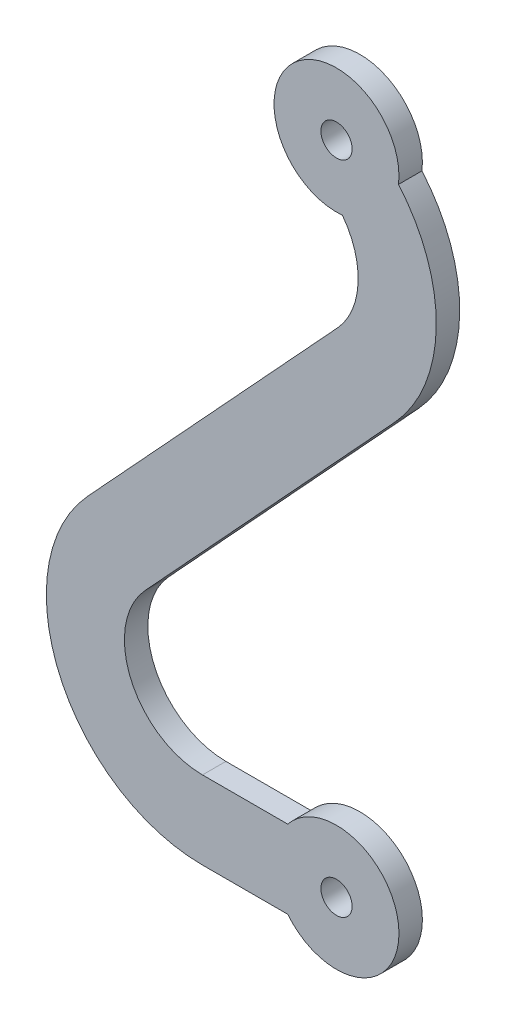
ISO-10303-21;
HEADER;
FILE_DESCRIPTION(('STEP AP214'),'2;1');
FILE_NAME('part.step','',(''),(''),'','','');
FILE_SCHEMA(('AUTOMOTIVE_DESIGN { 1 0 10303 214 1 1 1 1 }'));
ENDSEC;
DATA;
#1=APPLICATION_CONTEXT('core data for automotive mechanical design processes');
#2=APPLICATION_PROTOCOL_DEFINITION('international standard','automotive_design',2000,#1);
#3=PRODUCT_CONTEXT('',#1,'mechanical');
#4=PRODUCT('Part','Part','',(#3));
#5=PRODUCT_RELATED_PRODUCT_CATEGORY('part','',(#4));
#6=PRODUCT_DEFINITION_FORMATION('','',#4);
#7=PRODUCT_DEFINITION_CONTEXT('part definition',#1,'design');
#8=PRODUCT_DEFINITION('design','',#6,#7);
#9=PRODUCT_DEFINITION_SHAPE('','',#8);
#10=(LENGTH_UNIT() NAMED_UNIT(*) SI_UNIT(.MILLI.,.METRE.));
#11=(NAMED_UNIT(*) PLANE_ANGLE_UNIT() SI_UNIT($,.RADIAN.));
#12=(NAMED_UNIT(*) SI_UNIT($,.STERADIAN.) SOLID_ANGLE_UNIT());
#13=UNCERTAINTY_MEASURE_WITH_UNIT(LENGTH_MEASURE(1.E-05),#10,'distance_accuracy_value','');
#14=(GEOMETRIC_REPRESENTATION_CONTEXT(3) GLOBAL_UNCERTAINTY_ASSIGNED_CONTEXT((#13)) GLOBAL_UNIT_ASSIGNED_CONTEXT((#10,
#11,#12)) REPRESENTATION_CONTEXT('',''));
#15=CARTESIAN_POINT('',(0.,0.,0.));
#16=DIRECTION('',(0.,0.,1.));
#17=DIRECTION('',(1.,0.,0.));
#18=AXIS2_PLACEMENT_3D('',#15,#16,#17);
#19=CARTESIAN_POINT('',(-3.61103598299831,35.0044342652001,1.5));
#20=DIRECTION('',(0.,0.,1.));
#21=DIRECTION('',(1.,0.,0.));
#22=AXIS2_PLACEMENT_3D('',#19,#20,#21);
#23=PLANE('',#22);
#24=CARTESIAN_POINT('',(0.,0.,1.5));
#25=DIRECTION('',(0.,0.,1.));
#26=DIRECTION('',(1.,0.,0.));
#27=AXIS2_PLACEMENT_3D('',#24,#25,#26);
#28=CIRCLE('',#27,1.);
#29=CARTESIAN_POINT('',(1.,0.,1.5));
#30=VERTEX_POINT('',#29);
#31=EDGE_CURVE('E158',#30,#30,#28,.T.);
#32=ORIENTED_EDGE('',*,*,#31,.F.);
#33=EDGE_LOOP('',(#32));
#34=FACE_BOUND('',#33,.T.);
#35=CARTESIAN_POINT('',(-3.61103598299831,35.0044342652001,1.5));
#36=DIRECTION('',(0.,0.,-1.));
#37=DIRECTION('',(1.,0.,0.));
#38=AXIS2_PLACEMENT_3D('',#35,#36,#37);
#39=CIRCLE('',#38,5.);
#40=CARTESIAN_POINT('',(0.378773293230176,38.0179740341962,1.5));
#41=VERTEX_POINT('',#40);
#42=CARTESIAN_POINT('',(0.0634117858713278,31.6135002354896,1.5));
#43=VERTEX_POINT('',#42);
#44=EDGE_CURVE('E182',#41,#43,#39,.T.);
#45=ORIENTED_EDGE('',*,*,#44,.T.);
#46=DIRECTION('',(-0.678186805942109,-0.734889553773926,0.));
#47=VECTOR('',#46,1.);
#48=CARTESIAN_POINT('',(-15.9309430214461,14.2818680594211,1.5));
#49=LINE('',#48,#47);
#50=CARTESIAN_POINT('',(-15.9309430214461,14.2818680594211,1.5));
#51=VERTEX_POINT('',#50);
#52=EDGE_CURVE('E106',#43,#51,#49,.T.);
#53=ORIENTED_EDGE('',*,*,#52,.T.);
#54=CARTESIAN_POINT('',(-8.58204748370686,7.5,1.5));
#55=DIRECTION('',(0.,0.,1.));
#56=DIRECTION('',(-1.,0.,0.));
#57=AXIS2_PLACEMENT_3D('',#54,#55,#56);
#58=CIRCLE('',#57,10.);
#59=CARTESIAN_POINT('',(-8.58204748370686,-2.5,1.5));
#60=VERTEX_POINT('',#59);
#61=EDGE_CURVE('E211',#51,#60,#58,.T.);
#62=ORIENTED_EDGE('',*,*,#61,.T.);
#63=DIRECTION('',(1.,0.,0.));
#64=VECTOR('',#63,1.);
#65=CARTESIAN_POINT('',(-3.1224989991992,-2.5,1.5));
#66=LINE('',#65,#64);
#67=CARTESIAN_POINT('',(-3.1224989991992,-2.5,1.5));
#68=VERTEX_POINT('',#67);
#69=EDGE_CURVE('E231',#60,#68,#66,.T.);
#70=ORIENTED_EDGE('',*,*,#69,.T.);
#71=CARTESIAN_POINT('',(0.,0.,1.5));
#72=DIRECTION('',(0.,0.,1.));
#73=DIRECTION('',(1.,0.,0.));
#74=AXIS2_PLACEMENT_3D('',#71,#72,#73);
#75=CIRCLE('',#74,4.);
#76=CARTESIAN_POINT('',(-3.1224989991992,2.5,1.5));
#77=VERTEX_POINT('',#76);
#78=EDGE_CURVE('E227',#68,#77,#75,.T.);
#79=ORIENTED_EDGE('',*,*,#78,.T.);
#80=DIRECTION('',(-1.,0.,0.));
#81=VECTOR('',#80,1.);
#82=CARTESIAN_POINT('',(-3.1224989991992,2.5,1.5));
#83=LINE('',#82,#81);
#84=CARTESIAN_POINT('',(-8.58204748370686,2.5,1.5));
#85=VERTEX_POINT('',#84);
#86=EDGE_CURVE('E230',#77,#85,#83,.T.);
#87=ORIENTED_EDGE('',*,*,#86,.T.);
#88=CARTESIAN_POINT('',(-8.58204748370686,7.5,1.5));
#89=DIRECTION('',(0.,0.,-1.));
#90=DIRECTION('',(-1.,0.,0.));
#91=AXIS2_PLACEMENT_3D('',#88,#89,#90);
#92=CIRCLE('',#91,5.);
#93=CARTESIAN_POINT('',(-12.2564952525765,10.8909340297105,1.5));
#94=VERTEX_POINT('',#93);
#95=EDGE_CURVE('E131',#85,#94,#92,.T.);
#96=ORIENTED_EDGE('',*,*,#95,.T.);
#97=DIRECTION('',(0.678186805942109,0.734889553773926,0.));
#98=VECTOR('',#97,1.);
#99=CARTESIAN_POINT('',(-12.2564952525765,10.8909340297105,1.5));
#100=LINE('',#99,#98);
#101=CARTESIAN_POINT('',(3.73785955474095,28.222566205779,1.5));
#102=VERTEX_POINT('',#101);
#103=EDGE_CURVE('E125',#94,#102,#100,.T.);
#104=ORIENTED_EDGE('',*,*,#103,.T.);
#105=CARTESIAN_POINT('',(-3.61103598299831,35.0044342652001,1.5));
#106=DIRECTION('',(0.,0.,1.));
#107=DIRECTION('',(1.,0.,0.));
#108=AXIS2_PLACEMENT_3D('',#105,#106,#107);
#109=CIRCLE('',#108,10.);
#110=CARTESIAN_POINT('',(3.97157090737725,41.523949028281,1.5));
#111=VERTEX_POINT('',#110);
#112=EDGE_CURVE('E129',#102,#111,#109,.T.);
#113=ORIENTED_EDGE('',*,*,#112,.T.);
#114=CARTESIAN_POINT('',(0.,42.,1.5));
#115=DIRECTION('',(0.,0.,1.));
#116=DIRECTION('',(1.,0.,0.));
#117=AXIS2_PLACEMENT_3D('',#114,#115,#116);
#118=CIRCLE('',#117,4.);
#119=EDGE_CURVE('E57',#111,#41,#118,.T.);
#120=ORIENTED_EDGE('',*,*,#119,.T.);
#121=EDGE_LOOP('',(#45,#53,#62,#70,#79,#87,#96,#104,#113,#120));
#122=FACE_BOUND('',#121,.T.);
#123=CARTESIAN_POINT('',(0.,42.,1.5));
#124=DIRECTION('',(0.,0.,1.));
#125=DIRECTION('',(1.,0.,0.));
#126=AXIS2_PLACEMENT_3D('',#123,#124,#125);
#127=CIRCLE('',#126,1.);
#128=CARTESIAN_POINT('',(1.,42.,1.5));
#129=VERTEX_POINT('',#128);
#130=EDGE_CURVE('E249',#129,#129,#127,.T.);
#131=ORIENTED_EDGE('',*,*,#130,.F.);
#132=EDGE_LOOP('',(#131));
#133=FACE_BOUND('',#132,.T.);
#134=ADVANCED_FACE('F39',(#34,#122,#133),#23,.T.);
#135=CARTESIAN_POINT('',(-3.61103598299831,35.0044342652001,0.));
#136=DIRECTION('',(0.,0.,1.));
#137=DIRECTION('',(1.,0.,0.));
#138=AXIS2_PLACEMENT_3D('',#135,#136,#137);
#139=PLANE('',#138);
#140=CARTESIAN_POINT('',(-3.61103598299831,35.0044342652001,0.));
#141=DIRECTION('',(0.,0.,-1.));
#142=DIRECTION('',(1.,0.,0.));
#143=AXIS2_PLACEMENT_3D('',#140,#141,#142);
#144=CIRCLE('',#143,5.);
#145=CARTESIAN_POINT('',(0.378773293230176,38.0179740341962,0.));
#146=VERTEX_POINT('',#145);
#147=CARTESIAN_POINT('',(0.0634117858713278,31.6135002354896,0.));
#148=VERTEX_POINT('',#147);
#149=EDGE_CURVE('E153',#146,#148,#144,.T.);
#150=ORIENTED_EDGE('',*,*,#149,.F.);
#151=CARTESIAN_POINT('',(0.,42.,0.));
#152=DIRECTION('',(0.,0.,1.));
#153=DIRECTION('',(1.,0.,0.));
#154=AXIS2_PLACEMENT_3D('',#151,#152,#153);
#155=CIRCLE('',#154,4.);
#156=CARTESIAN_POINT('',(3.97157090737725,41.523949028281,0.));
#157=VERTEX_POINT('',#156);
#158=EDGE_CURVE('E98',#157,#146,#155,.T.);
#159=ORIENTED_EDGE('',*,*,#158,.F.);
#160=CARTESIAN_POINT('',(-3.61103598299831,35.0044342652001,0.));
#161=DIRECTION('',(0.,0.,1.));
#162=DIRECTION('',(1.,0.,0.));
#163=AXIS2_PLACEMENT_3D('',#160,#161,#162);
#164=CIRCLE('',#163,10.);
#165=CARTESIAN_POINT('',(3.73785955474095,28.222566205779,0.));
#166=VERTEX_POINT('',#165);
#167=EDGE_CURVE('E92',#166,#157,#164,.T.);
#168=ORIENTED_EDGE('',*,*,#167,.F.);
#169=DIRECTION('',(0.678186805942109,0.734889553773926,0.));
#170=VECTOR('',#169,1.);
#171=CARTESIAN_POINT('',(-12.2564952525765,10.8909340297105,0.));
#172=LINE('',#171,#170);
#173=CARTESIAN_POINT('',(-12.2564952525765,10.8909340297105,0.));
#174=VERTEX_POINT('',#173);
#175=EDGE_CURVE('E140',#174,#166,#172,.T.);
#176=ORIENTED_EDGE('',*,*,#175,.F.);
#177=CARTESIAN_POINT('',(-8.58204748370686,7.5,0.));
#178=DIRECTION('',(0.,0.,-1.));
#179=DIRECTION('',(-1.,0.,0.));
#180=AXIS2_PLACEMENT_3D('',#177,#178,#179);
#181=CIRCLE('',#180,5.);
#182=CARTESIAN_POINT('',(-8.58204748370686,2.5,0.));
#183=VERTEX_POINT('',#182);
#184=EDGE_CURVE('E173',#183,#174,#181,.T.);
#185=ORIENTED_EDGE('',*,*,#184,.F.);
#186=DIRECTION('',(-1.,0.,0.));
#187=VECTOR('',#186,1.);
#188=CARTESIAN_POINT('',(-3.1224989991992,2.5,0.));
#189=LINE('',#188,#187);
#190=CARTESIAN_POINT('',(-3.1224989991992,2.5,0.));
#191=VERTEX_POINT('',#190);
#192=EDGE_CURVE('E170',#191,#183,#189,.T.);
#193=ORIENTED_EDGE('',*,*,#192,.F.);
#194=CARTESIAN_POINT('',(0.,0.,0.));
#195=DIRECTION('',(0.,0.,1.));
#196=DIRECTION('',(1.,0.,0.));
#197=AXIS2_PLACEMENT_3D('',#194,#195,#196);
#198=CIRCLE('',#197,4.);
#199=CARTESIAN_POINT('',(-3.1224989991992,-2.5,0.));
#200=VERTEX_POINT('',#199);
#201=EDGE_CURVE('E167',#200,#191,#198,.T.);
#202=ORIENTED_EDGE('',*,*,#201,.F.);
#203=DIRECTION('',(1.,0.,0.));
#204=VECTOR('',#203,1.);
#205=CARTESIAN_POINT('',(-3.1224989991992,-2.5,0.));
#206=LINE('',#205,#204);
#207=CARTESIAN_POINT('',(-8.58204748370686,-2.5,0.));
#208=VERTEX_POINT('',#207);
#209=EDGE_CURVE('E164',#208,#200,#206,.T.);
#210=ORIENTED_EDGE('',*,*,#209,.F.);
#211=CARTESIAN_POINT('',(-8.58204748370686,7.5,0.));
#212=DIRECTION('',(0.,0.,1.));
#213=DIRECTION('',(-1.,0.,0.));
#214=AXIS2_PLACEMENT_3D('',#211,#212,#213);
#215=CIRCLE('',#214,10.);
#216=CARTESIAN_POINT('',(-15.9309430214461,14.2818680594211,0.));
#217=VERTEX_POINT('',#216);
#218=EDGE_CURVE('E161',#217,#208,#215,.T.);
#219=ORIENTED_EDGE('',*,*,#218,.F.);
#220=DIRECTION('',(-0.678186805942109,-0.734889553773926,0.));
#221=VECTOR('',#220,1.);
#222=CARTESIAN_POINT('',(-15.9309430214461,14.2818680594211,0.));
#223=LINE('',#222,#221);
#224=EDGE_CURVE('E157',#148,#217,#223,.T.);
#225=ORIENTED_EDGE('',*,*,#224,.F.);
#226=EDGE_LOOP('',(#150,#159,#168,#176,#185,#193,#202,#210,#219,#225));
#227=FACE_BOUND('',#226,.T.);
#228=CARTESIAN_POINT('',(0.,0.,0.));
#229=DIRECTION('',(0.,0.,1.));
#230=DIRECTION('',(1.,0.,0.));
#231=AXIS2_PLACEMENT_3D('',#228,#229,#230);
#232=CIRCLE('',#231,1.);
#233=CARTESIAN_POINT('',(1.,0.,0.));
#234=VERTEX_POINT('',#233);
#235=EDGE_CURVE('E245',#234,#234,#232,.T.);
#236=ORIENTED_EDGE('',*,*,#235,.T.);
#237=EDGE_LOOP('',(#236));
#238=FACE_BOUND('',#237,.T.);
#239=CARTESIAN_POINT('',(0.,42.,0.));
#240=DIRECTION('',(0.,0.,1.));
#241=DIRECTION('',(1.,0.,0.));
#242=AXIS2_PLACEMENT_3D('',#239,#240,#241);
#243=CIRCLE('',#242,1.);
#244=CARTESIAN_POINT('',(1.,42.,0.));
#245=VERTEX_POINT('',#244);
#246=EDGE_CURVE('E253',#245,#245,#243,.T.);
#247=ORIENTED_EDGE('',*,*,#246,.T.);
#248=EDGE_LOOP('',(#247));
#249=FACE_BOUND('',#248,.T.);
#250=ADVANCED_FACE('F215',(#227,#238,#249),#139,.F.);
#251=CARTESIAN_POINT('',(-3.61103598299831,35.0044342652001,1.5));
#252=DIRECTION('',(0.,0.,-1.));
#253=DIRECTION('',(-1.,0.,0.));
#254=AXIS2_PLACEMENT_3D('',#251,#252,#253);
#255=CYLINDRICAL_SURFACE('',#254,5.);
#256=ORIENTED_EDGE('',*,*,#149,.T.);
#257=DIRECTION('',(0.,0.,-1.));
#258=VECTOR('',#257,1.);
#259=CARTESIAN_POINT('',(0.0634117858713278,31.6135002354896,1.5));
#260=LINE('',#259,#258);
#261=EDGE_CURVE('E11',#43,#148,#260,.T.);
#262=ORIENTED_EDGE('',*,*,#261,.F.);
#263=ORIENTED_EDGE('',*,*,#44,.F.);
#264=DIRECTION('',(0.,0.,-1.));
#265=VECTOR('',#264,1.);
#266=CARTESIAN_POINT('',(0.378773293230176,38.0179740341962,1.5));
#267=LINE('',#266,#265);
#268=EDGE_CURVE('E149',#41,#146,#267,.T.);
#269=ORIENTED_EDGE('',*,*,#268,.T.);
#270=EDGE_LOOP('',(#256,#262,#263,#269));
#271=FACE_BOUND('',#270,.T.);
#272=ADVANCED_FACE('F41',(#271),#255,.F.);
#273=CARTESIAN_POINT('',(-15.9309430214461,14.2818680594211,1.5));
#274=DIRECTION('',(0.734889553773926,-0.678186805942109,0.));
#275=DIRECTION('',(0.678186805942109,0.734889553773926,0.));
#276=AXIS2_PLACEMENT_3D('',#273,#274,#275);
#277=PLANE('',#276);
#278=ORIENTED_EDGE('',*,*,#224,.T.);
#279=DIRECTION('',(0.,0.,-1.));
#280=VECTOR('',#279,1.);
#281=CARTESIAN_POINT('',(-15.9309430214461,14.2818680594211,1.5));
#282=LINE('',#281,#280);
#283=EDGE_CURVE('E49',#51,#217,#282,.T.);
#284=ORIENTED_EDGE('',*,*,#283,.F.);
#285=ORIENTED_EDGE('',*,*,#52,.F.);
#286=ORIENTED_EDGE('',*,*,#261,.T.);
#287=EDGE_LOOP('',(#278,#284,#285,#286));
#288=FACE_BOUND('',#287,.T.);
#289=ADVANCED_FACE('F295',(#288),#277,.F.);
#290=CARTESIAN_POINT('',(-8.58204748370686,7.5,1.5));
#291=DIRECTION('',(0.,0.,-1.));
#292=DIRECTION('',(-1.,0.,0.));
#293=AXIS2_PLACEMENT_3D('',#290,#291,#292);
#294=CYLINDRICAL_SURFACE('',#293,10.);
#295=ORIENTED_EDGE('',*,*,#218,.T.);
#296=DIRECTION('',(0.,0.,-1.));
#297=VECTOR('',#296,1.);
#298=CARTESIAN_POINT('',(-8.58204748370686,-2.5,1.5));
#299=LINE('',#298,#297);
#300=EDGE_CURVE('E201',#60,#208,#299,.T.);
#301=ORIENTED_EDGE('',*,*,#300,.F.);
#302=ORIENTED_EDGE('',*,*,#61,.F.);
#303=ORIENTED_EDGE('',*,*,#283,.T.);
#304=EDGE_LOOP('',(#295,#301,#302,#303));
#305=FACE_BOUND('',#304,.T.);
#306=ADVANCED_FACE('F209',(#305),#294,.T.);
#307=CARTESIAN_POINT('',(-3.1224989991992,-2.5,1.5));
#308=DIRECTION('',(0.,1.,0.));
#309=DIRECTION('',(0.,0.,1.));
#310=AXIS2_PLACEMENT_3D('',#307,#308,#309);
#311=PLANE('',#310);
#312=ORIENTED_EDGE('',*,*,#209,.T.);
#313=DIRECTION('',(0.,0.,-1.));
#314=VECTOR('',#313,1.);
#315=CARTESIAN_POINT('',(-3.1224989991992,-2.5,1.5));
#316=LINE('',#315,#314);
#317=EDGE_CURVE('E197',#68,#200,#316,.T.);
#318=ORIENTED_EDGE('',*,*,#317,.F.);
#319=ORIENTED_EDGE('',*,*,#69,.F.);
#320=ORIENTED_EDGE('',*,*,#300,.T.);
#321=EDGE_LOOP('',(#312,#318,#319,#320));
#322=FACE_BOUND('',#321,.T.);
#323=ADVANCED_FACE('F221',(#322),#311,.F.);
#324=CARTESIAN_POINT('',(0.,0.,1.5));
#325=DIRECTION('',(0.,0.,-1.));
#326=DIRECTION('',(-1.,0.,0.));
#327=AXIS2_PLACEMENT_3D('',#324,#325,#326);
#328=CYLINDRICAL_SURFACE('',#327,4.);
#329=ORIENTED_EDGE('',*,*,#201,.T.);
#330=DIRECTION('',(0.,0.,-1.));
#331=VECTOR('',#330,1.);
#332=CARTESIAN_POINT('',(-3.1224989991992,2.5,1.5));
#333=LINE('',#332,#331);
#334=EDGE_CURVE('E193',#77,#191,#333,.T.);
#335=ORIENTED_EDGE('',*,*,#334,.F.);
#336=ORIENTED_EDGE('',*,*,#78,.F.);
#337=ORIENTED_EDGE('',*,*,#317,.T.);
#338=EDGE_LOOP('',(#329,#335,#336,#337));
#339=FACE_BOUND('',#338,.T.);
#340=ADVANCED_FACE('F225',(#339),#328,.T.);
#341=CARTESIAN_POINT('',(-3.1224989991992,2.5,1.5));
#342=DIRECTION('',(0.,-1.,0.));
#343=DIRECTION('',(1.,0.,0.));
#344=AXIS2_PLACEMENT_3D('',#341,#342,#343);
#345=PLANE('',#344);
#346=ORIENTED_EDGE('',*,*,#192,.T.);
#347=DIRECTION('',(0.,0.,-1.));
#348=VECTOR('',#347,1.);
#349=CARTESIAN_POINT('',(-8.58204748370686,2.5,1.5));
#350=LINE('',#349,#348);
#351=EDGE_CURVE('E189',#85,#183,#350,.T.);
#352=ORIENTED_EDGE('',*,*,#351,.F.);
#353=ORIENTED_EDGE('',*,*,#86,.F.);
#354=ORIENTED_EDGE('',*,*,#334,.T.);
#355=EDGE_LOOP('',(#346,#352,#353,#354));
#356=FACE_BOUND('',#355,.T.);
#357=ADVANCED_FACE('F285',(#356),#345,.F.);
#358=CARTESIAN_POINT('',(-8.58204748370686,7.5,1.5));
#359=DIRECTION('',(0.,0.,-1.));
#360=DIRECTION('',(-1.,0.,0.));
#361=AXIS2_PLACEMENT_3D('',#358,#359,#360);
#362=CYLINDRICAL_SURFACE('',#361,5.);
#363=ORIENTED_EDGE('',*,*,#184,.T.);
#364=DIRECTION('',(0.,0.,-1.));
#365=VECTOR('',#364,1.);
#366=CARTESIAN_POINT('',(-12.2564952525765,10.8909340297105,1.5));
#367=LINE('',#366,#365);
#368=EDGE_CURVE('E142',#94,#174,#367,.T.);
#369=ORIENTED_EDGE('',*,*,#368,.F.);
#370=ORIENTED_EDGE('',*,*,#95,.F.);
#371=ORIENTED_EDGE('',*,*,#351,.T.);
#372=EDGE_LOOP('',(#363,#369,#370,#371));
#373=FACE_BOUND('',#372,.T.);
#374=ADVANCED_FACE('F282',(#373),#362,.F.);
#375=CARTESIAN_POINT('',(-12.2564952525765,10.8909340297105,1.5));
#376=DIRECTION('',(-0.734889553773926,0.678186805942109,0.));
#377=DIRECTION('',(-0.678186805942109,-0.734889553773926,0.));
#378=AXIS2_PLACEMENT_3D('',#375,#376,#377);
#379=PLANE('',#378);
#380=ORIENTED_EDGE('',*,*,#175,.T.);
#381=DIRECTION('',(0.,0.,-1.));
#382=VECTOR('',#381,1.);
#383=CARTESIAN_POINT('',(3.73785955474095,28.222566205779,1.5));
#384=LINE('',#383,#382);
#385=EDGE_CURVE('E137',#102,#166,#384,.T.);
#386=ORIENTED_EDGE('',*,*,#385,.F.);
#387=ORIENTED_EDGE('',*,*,#103,.F.);
#388=ORIENTED_EDGE('',*,*,#368,.T.);
#389=EDGE_LOOP('',(#380,#386,#387,#388));
#390=FACE_BOUND('',#389,.T.);
#391=ADVANCED_FACE('F138',(#390),#379,.F.);
#392=CARTESIAN_POINT('',(-3.61103598299831,35.0044342652001,1.5));
#393=DIRECTION('',(0.,0.,-1.));
#394=DIRECTION('',(-1.,0.,0.));
#395=AXIS2_PLACEMENT_3D('',#392,#393,#394);
#396=CYLINDRICAL_SURFACE('',#395,10.);
#397=ORIENTED_EDGE('',*,*,#167,.T.);
#398=DIRECTION('',(0.,0.,-1.));
#399=VECTOR('',#398,1.);
#400=CARTESIAN_POINT('',(3.97157090737725,41.523949028281,1.5));
#401=LINE('',#400,#399);
#402=EDGE_CURVE('E143',#111,#157,#401,.T.);
#403=ORIENTED_EDGE('',*,*,#402,.F.);
#404=ORIENTED_EDGE('',*,*,#112,.F.);
#405=ORIENTED_EDGE('',*,*,#385,.T.);
#406=EDGE_LOOP('',(#397,#403,#404,#405));
#407=FACE_BOUND('',#406,.T.);
#408=ADVANCED_FACE('F145',(#407),#396,.T.);
#409=CARTESIAN_POINT('',(0.,42.,1.5));
#410=DIRECTION('',(0.,0.,-1.));
#411=DIRECTION('',(-1.,0.,0.));
#412=AXIS2_PLACEMENT_3D('',#409,#410,#411);
#413=CYLINDRICAL_SURFACE('',#412,4.);
#414=ORIENTED_EDGE('',*,*,#158,.T.);
#415=ORIENTED_EDGE('',*,*,#268,.F.);
#416=ORIENTED_EDGE('',*,*,#119,.F.);
#417=ORIENTED_EDGE('',*,*,#402,.T.);
#418=EDGE_LOOP('',(#414,#415,#416,#417));
#419=FACE_BOUND('',#418,.T.);
#420=ADVANCED_FACE('F275',(#419),#413,.T.);
#421=CARTESIAN_POINT('',(0.,0.,1.5));
#422=DIRECTION('',(0.,0.,-1.));
#423=DIRECTION('',(-1.,0.,0.));
#424=AXIS2_PLACEMENT_3D('',#421,#422,#423);
#425=CYLINDRICAL_SURFACE('',#424,1.);
#426=ORIENTED_EDGE('',*,*,#31,.T.);
#427=EDGE_LOOP('',(#426));
#428=FACE_BOUND('',#427,.T.);
#429=ORIENTED_EDGE('',*,*,#235,.F.);
#430=EDGE_LOOP('',(#429));
#431=FACE_BOUND('',#430,.T.);
#432=ADVANCED_FACE('F272',(#428,#431),#425,.F.);
#433=CARTESIAN_POINT('',(0.,42.,1.5));
#434=DIRECTION('',(0.,0.,-1.));
#435=DIRECTION('',(-1.,0.,0.));
#436=AXIS2_PLACEMENT_3D('',#433,#434,#435);
#437=CYLINDRICAL_SURFACE('',#436,1.);
#438=ORIENTED_EDGE('',*,*,#130,.T.);
#439=EDGE_LOOP('',(#438));
#440=FACE_BOUND('',#439,.T.);
#441=ORIENTED_EDGE('',*,*,#246,.F.);
#442=EDGE_LOOP('',(#441));
#443=FACE_BOUND('',#442,.T.);
#444=ADVANCED_FACE('F261',(#440,#443),#437,.F.);
#445=CLOSED_SHELL('',(#134,#250,#272,#289,#306,#323,#340,#357,#374,#391,#408,#420,#432,#444));
#446=MANIFOLD_SOLID_BREP('B2',#445);
#447=ADVANCED_BREP_SHAPE_REPRESENTATION('',(#18,#446),#14);
#448=SHAPE_DEFINITION_REPRESENTATION(#9,#447);
ENDSEC;
END-ISO-10303-21;
